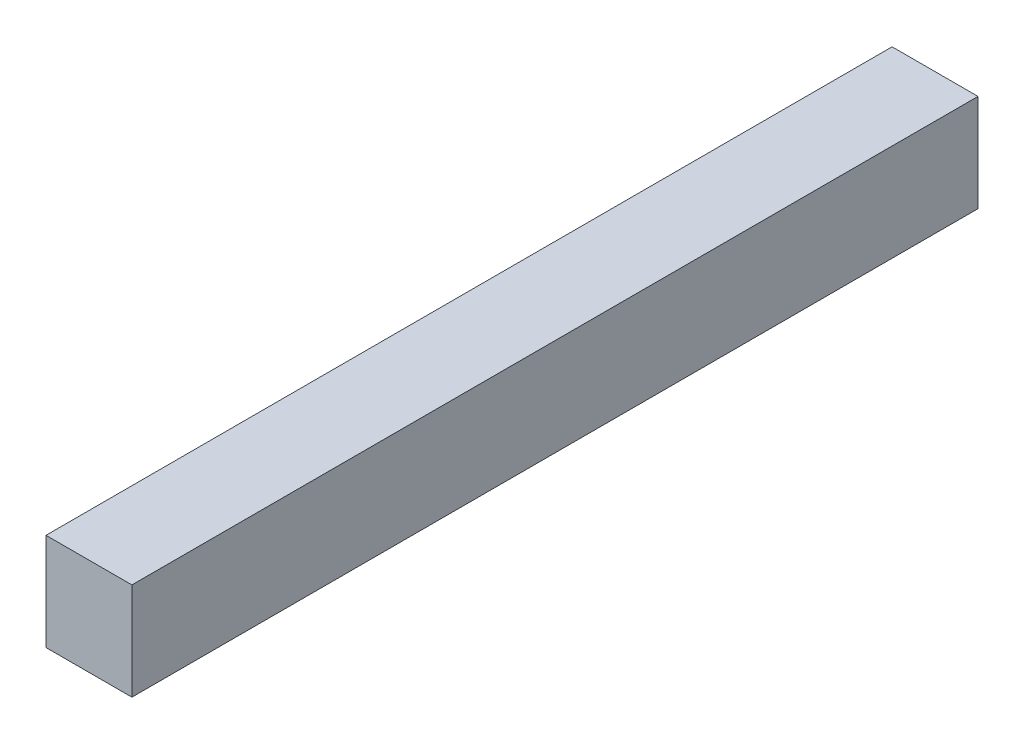
ISO-10303-21;
HEADER;
FILE_DESCRIPTION(('STEP AP214'),'2;1');
FILE_NAME('part.step','',(''),(''),'','','');
FILE_SCHEMA(('AUTOMOTIVE_DESIGN { 1 0 10303 214 1 1 1 1 }'));
ENDSEC;
DATA;
#1=APPLICATION_CONTEXT('core data for automotive mechanical design processes');
#2=APPLICATION_PROTOCOL_DEFINITION('international standard','automotive_design',2000,#1);
#3=PRODUCT_CONTEXT('',#1,'mechanical');
#4=PRODUCT('Part','Part','',(#3));
#5=PRODUCT_RELATED_PRODUCT_CATEGORY('part','',(#4));
#6=PRODUCT_DEFINITION_FORMATION('','',#4);
#7=PRODUCT_DEFINITION_CONTEXT('part definition',#1,'design');
#8=PRODUCT_DEFINITION('design','',#6,#7);
#9=PRODUCT_DEFINITION_SHAPE('','',#8);
#10=(LENGTH_UNIT() NAMED_UNIT(*) SI_UNIT(.MILLI.,.METRE.));
#11=(NAMED_UNIT(*) PLANE_ANGLE_UNIT() SI_UNIT($,.RADIAN.));
#12=(NAMED_UNIT(*) SI_UNIT($,.STERADIAN.) SOLID_ANGLE_UNIT());
#13=UNCERTAINTY_MEASURE_WITH_UNIT(LENGTH_MEASURE(1.E-05),#10,'distance_accuracy_value','');
#14=(GEOMETRIC_REPRESENTATION_CONTEXT(3) GLOBAL_UNCERTAINTY_ASSIGNED_CONTEXT((#13)) GLOBAL_UNIT_ASSIGNED_CONTEXT((#10,
#11,#12)) REPRESENTATION_CONTEXT('',''));
#15=CARTESIAN_POINT('',(0.,0.,0.));
#16=DIRECTION('',(0.,0.,1.));
#17=DIRECTION('',(1.,0.,0.));
#18=AXIS2_PLACEMENT_3D('',#15,#16,#17);
#19=CARTESIAN_POINT('',(67.31,-76.2,662.94));
#20=DIRECTION('',(-1.,0.,0.));
#21=DIRECTION('',(0.,0.,1.));
#22=AXIS2_PLACEMENT_3D('',#19,#20,#21);
#23=PLANE('',#22);
#24=DIRECTION('',(0.,1.,0.));
#25=VECTOR('',#24,1.);
#26=CARTESIAN_POINT('',(67.31,-76.2,-662.94));
#27=LINE('',#26,#25);
#28=CARTESIAN_POINT('',(67.31,-76.2,-662.94));
#29=VERTEX_POINT('',#28);
#30=CARTESIAN_POINT('',(67.31,76.2,-662.94));
#31=VERTEX_POINT('',#30);
#32=EDGE_CURVE('E96',#29,#31,#27,.T.);
#33=ORIENTED_EDGE('',*,*,#32,.T.);
#34=DIRECTION('',(0.,0.,-1.));
#35=VECTOR('',#34,1.);
#36=CARTESIAN_POINT('',(67.31,76.2,662.94));
#37=LINE('',#36,#35);
#38=CARTESIAN_POINT('',(67.31,76.2,662.94));
#39=VERTEX_POINT('',#38);
#40=EDGE_CURVE('E11',#39,#31,#37,.T.);
#41=ORIENTED_EDGE('',*,*,#40,.F.);
#42=DIRECTION('',(0.,1.,0.));
#43=VECTOR('',#42,1.);
#44=CARTESIAN_POINT('',(67.31,-76.2,662.94));
#45=LINE('',#44,#43);
#46=CARTESIAN_POINT('',(67.31,-76.2,662.94));
#47=VERTEX_POINT('',#46);
#48=EDGE_CURVE('E84',#47,#39,#45,.T.);
#49=ORIENTED_EDGE('',*,*,#48,.F.);
#50=DIRECTION('',(0.,0.,-1.));
#51=VECTOR('',#50,1.);
#52=CARTESIAN_POINT('',(67.31,-76.2,662.94));
#53=LINE('',#52,#51);
#54=EDGE_CURVE('E92',#47,#29,#53,.T.);
#55=ORIENTED_EDGE('',*,*,#54,.T.);
#56=EDGE_LOOP('',(#33,#41,#49,#55));
#57=FACE_BOUND('',#56,.T.);
#58=ADVANCED_FACE('F33',(#57),#23,.F.);
#59=CARTESIAN_POINT('',(-67.31,76.2,662.94));
#60=DIRECTION('',(0.,-1.,0.));
#61=DIRECTION('',(0.,0.,-1.));
#62=AXIS2_PLACEMENT_3D('',#59,#60,#61);
#63=PLANE('',#62);
#64=DIRECTION('',(-1.,0.,0.));
#65=VECTOR('',#64,1.);
#66=CARTESIAN_POINT('',(-67.31,76.2,-662.94));
#67=LINE('',#66,#65);
#68=CARTESIAN_POINT('',(-67.31,76.2,-662.94));
#69=VERTEX_POINT('',#68);
#70=EDGE_CURVE('E88',#31,#69,#67,.T.);
#71=ORIENTED_EDGE('',*,*,#70,.T.);
#72=DIRECTION('',(0.,0.,-1.));
#73=VECTOR('',#72,1.);
#74=CARTESIAN_POINT('',(-67.31,76.2,662.94));
#75=LINE('',#74,#73);
#76=CARTESIAN_POINT('',(-67.31,76.2,662.94));
#77=VERTEX_POINT('',#76);
#78=EDGE_CURVE('E41',#77,#69,#75,.T.);
#79=ORIENTED_EDGE('',*,*,#78,.F.);
#80=DIRECTION('',(-1.,0.,0.));
#81=VECTOR('',#80,1.);
#82=CARTESIAN_POINT('',(-67.31,76.2,662.94));
#83=LINE('',#82,#81);
#84=EDGE_CURVE('E79',#39,#77,#83,.T.);
#85=ORIENTED_EDGE('',*,*,#84,.F.);
#86=ORIENTED_EDGE('',*,*,#40,.T.);
#87=EDGE_LOOP('',(#71,#79,#85,#86));
#88=FACE_BOUND('',#87,.T.);
#89=ADVANCED_FACE('F87',(#88),#63,.F.);
#90=CARTESIAN_POINT('',(-67.31,-76.2,662.94));
#91=DIRECTION('',(1.,0.,0.));
#92=DIRECTION('',(0.,0.,-1.));
#93=AXIS2_PLACEMENT_3D('',#90,#91,#92);
#94=PLANE('',#93);
#95=DIRECTION('',(0.,-1.,0.));
#96=VECTOR('',#95,1.);
#97=CARTESIAN_POINT('',(-67.31,-76.2,-662.94));
#98=LINE('',#97,#96);
#99=CARTESIAN_POINT('',(-67.31,-76.2,-662.94));
#100=VERTEX_POINT('',#99);
#101=EDGE_CURVE('E66',#69,#100,#98,.T.);
#102=ORIENTED_EDGE('',*,*,#101,.T.);
#103=DIRECTION('',(0.,0.,-1.));
#104=VECTOR('',#103,1.);
#105=CARTESIAN_POINT('',(-67.31,-76.2,662.94));
#106=LINE('',#105,#104);
#107=CARTESIAN_POINT('',(-67.31,-76.2,662.94));
#108=VERTEX_POINT('',#107);
#109=EDGE_CURVE('E89',#108,#100,#106,.T.);
#110=ORIENTED_EDGE('',*,*,#109,.F.);
#111=DIRECTION('',(0.,-1.,0.));
#112=VECTOR('',#111,1.);
#113=CARTESIAN_POINT('',(-67.31,-76.2,662.94));
#114=LINE('',#113,#112);
#115=EDGE_CURVE('E82',#77,#108,#114,.T.);
#116=ORIENTED_EDGE('',*,*,#115,.F.);
#117=ORIENTED_EDGE('',*,*,#78,.T.);
#118=EDGE_LOOP('',(#102,#110,#116,#117));
#119=FACE_BOUND('',#118,.T.);
#120=ADVANCED_FACE('F90',(#119),#94,.F.);
#121=CARTESIAN_POINT('',(-67.31,-76.2,662.94));
#122=DIRECTION('',(0.,1.,0.));
#123=DIRECTION('',(0.,0.,1.));
#124=AXIS2_PLACEMENT_3D('',#121,#122,#123);
#125=PLANE('',#124);
#126=DIRECTION('',(1.,0.,0.));
#127=VECTOR('',#126,1.);
#128=CARTESIAN_POINT('',(-67.31,-76.2,-662.94));
#129=LINE('',#128,#127);
#130=EDGE_CURVE('E72',#100,#29,#129,.T.);
#131=ORIENTED_EDGE('',*,*,#130,.T.);
#132=ORIENTED_EDGE('',*,*,#54,.F.);
#133=DIRECTION('',(1.,0.,0.));
#134=VECTOR('',#133,1.);
#135=CARTESIAN_POINT('',(-67.31,-76.2,662.94));
#136=LINE('',#135,#134);
#137=EDGE_CURVE('E49',#108,#47,#136,.T.);
#138=ORIENTED_EDGE('',*,*,#137,.F.);
#139=ORIENTED_EDGE('',*,*,#109,.T.);
#140=EDGE_LOOP('',(#131,#132,#138,#139));
#141=FACE_BOUND('',#140,.T.);
#142=ADVANCED_FACE('F103',(#141),#125,.F.);
#143=CARTESIAN_POINT('',(0.,0.,662.94));
#144=DIRECTION('',(0.,0.,-1.));
#145=DIRECTION('',(-1.,0.,0.));
#146=AXIS2_PLACEMENT_3D('',#143,#144,#145);
#147=PLANE('',#146);
#148=ORIENTED_EDGE('',*,*,#48,.T.);
#149=ORIENTED_EDGE('',*,*,#84,.T.);
#150=ORIENTED_EDGE('',*,*,#115,.T.);
#151=ORIENTED_EDGE('',*,*,#137,.T.);
#152=EDGE_LOOP('',(#148,#149,#150,#151));
#153=FACE_BOUND('',#152,.T.);
#154=ADVANCED_FACE('F80',(#153),#147,.F.);
#155=CARTESIAN_POINT('',(0.,0.,-662.94));
#156=DIRECTION('',(0.,0.,-1.));
#157=DIRECTION('',(-1.,0.,0.));
#158=AXIS2_PLACEMENT_3D('',#155,#156,#157);
#159=PLANE('',#158);
#160=ORIENTED_EDGE('',*,*,#32,.F.);
#161=ORIENTED_EDGE('',*,*,#130,.F.);
#162=ORIENTED_EDGE('',*,*,#101,.F.);
#163=ORIENTED_EDGE('',*,*,#70,.F.);
#164=EDGE_LOOP('',(#160,#161,#162,#163));
#165=FACE_BOUND('',#164,.T.);
#166=ADVANCED_FACE('F106',(#165),#159,.T.);
#167=CLOSED_SHELL('',(#58,#89,#120,#142,#154,#166));
#168=MANIFOLD_SOLID_BREP('B2',#167);
#169=ADVANCED_BREP_SHAPE_REPRESENTATION('',(#18,#168),#14);
#170=SHAPE_DEFINITION_REPRESENTATION(#9,#169);
ENDSEC;
END-ISO-10303-21;
